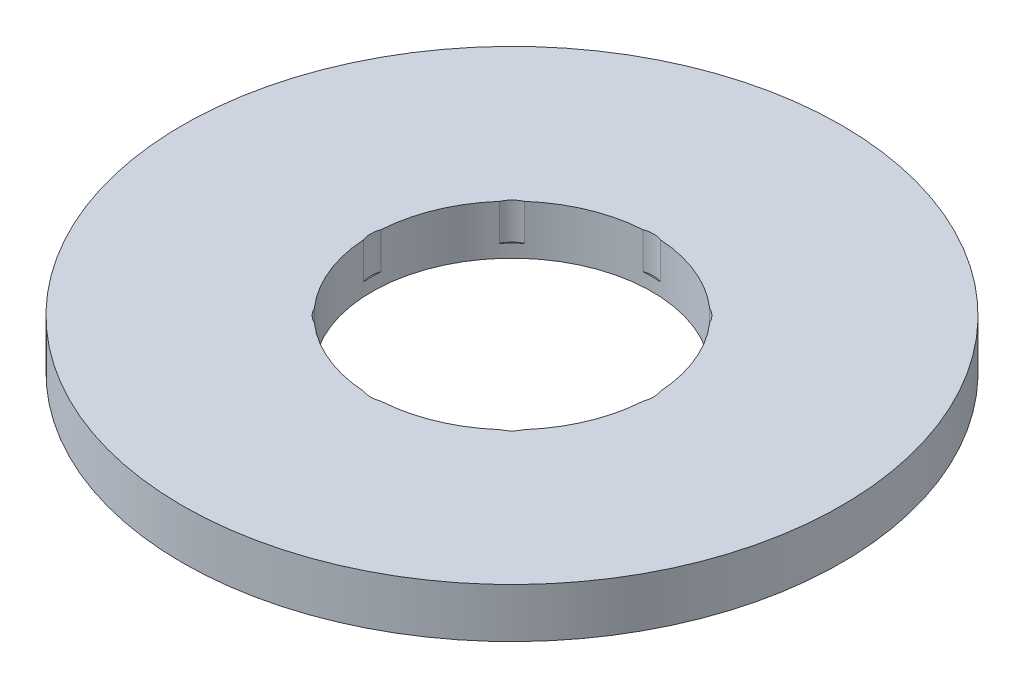
ISO-10303-21;
HEADER;
FILE_DESCRIPTION(('STEP AP214'),'2;1');
FILE_NAME('part.step','',(''),(''),'','','');
FILE_SCHEMA(('AUTOMOTIVE_DESIGN { 1 0 10303 214 1 1 1 1 }'));
ENDSEC;
DATA;
#1=APPLICATION_CONTEXT('core data for automotive mechanical design processes');
#2=APPLICATION_PROTOCOL_DEFINITION('international standard','automotive_design',2000,#1);
#3=PRODUCT_CONTEXT('',#1,'mechanical');
#4=PRODUCT('Part','Part','',(#3));
#5=PRODUCT_RELATED_PRODUCT_CATEGORY('part','',(#4));
#6=PRODUCT_DEFINITION_FORMATION('','',#4);
#7=PRODUCT_DEFINITION_CONTEXT('part definition',#1,'design');
#8=PRODUCT_DEFINITION('design','',#6,#7);
#9=PRODUCT_DEFINITION_SHAPE('','',#8);
#10=(LENGTH_UNIT() NAMED_UNIT(*) SI_UNIT(.MILLI.,.METRE.));
#11=(NAMED_UNIT(*) PLANE_ANGLE_UNIT() SI_UNIT($,.RADIAN.));
#12=(NAMED_UNIT(*) SI_UNIT($,.STERADIAN.) SOLID_ANGLE_UNIT());
#13=UNCERTAINTY_MEASURE_WITH_UNIT(LENGTH_MEASURE(1.E-05),#10,'distance_accuracy_value','');
#14=(GEOMETRIC_REPRESENTATION_CONTEXT(3) GLOBAL_UNCERTAINTY_ASSIGNED_CONTEXT((#13)) GLOBAL_UNIT_ASSIGNED_CONTEXT((#10,
#11,#12)) REPRESENTATION_CONTEXT('',''));
#15=CARTESIAN_POINT('',(0.,0.,0.));
#16=DIRECTION('',(0.,0.,1.));
#17=DIRECTION('',(1.,0.,0.));
#18=AXIS2_PLACEMENT_3D('',#15,#16,#17);
#19=CARTESIAN_POINT('',(0.,15.,0.));
#20=DIRECTION('',(0.,-1.,0.));
#21=DIRECTION('',(0.,0.,-1.));
#22=AXIS2_PLACEMENT_3D('',#19,#20,#21);
#23=CYLINDRICAL_SURFACE('',#22,100.);
#24=CARTESIAN_POINT('',(0.,15.,0.));
#25=DIRECTION('',(0.,1.,0.));
#26=DIRECTION('',(0.,0.,1.));
#27=AXIS2_PLACEMENT_3D('',#24,#25,#26);
#28=CIRCLE('',#27,100.);
#29=CARTESIAN_POINT('',(0.,15.,100.));
#30=VERTEX_POINT('',#29);
#31=EDGE_CURVE('E183',#30,#30,#28,.T.);
#32=ORIENTED_EDGE('',*,*,#31,.F.);
#33=EDGE_LOOP('',(#32));
#34=FACE_BOUND('',#33,.T.);
#35=CARTESIAN_POINT('',(0.,0.,0.));
#36=DIRECTION('',(0.,1.,0.));
#37=DIRECTION('',(0.,0.,1.));
#38=AXIS2_PLACEMENT_3D('',#35,#36,#37);
#39=CIRCLE('',#38,100.);
#40=CARTESIAN_POINT('',(0.,0.,100.));
#41=VERTEX_POINT('',#40);
#42=EDGE_CURVE('E182',#41,#41,#39,.T.);
#43=ORIENTED_EDGE('',*,*,#42,.T.);
#44=EDGE_LOOP('',(#43));
#45=FACE_BOUND('',#44,.T.);
#46=ADVANCED_FACE('F39',(#34,#45),#23,.T.);
#47=CARTESIAN_POINT('',(0.,15.,0.));
#48=DIRECTION('',(0.,1.,0.));
#49=DIRECTION('',(0.,0.,1.));
#50=AXIS2_PLACEMENT_3D('',#47,#48,#49);
#51=PLANE('',#50);
#52=CARTESIAN_POINT('',(1.22882616047543E-13,15.,35.1949800448479));
#53=DIRECTION('',(0.,1.,0.));
#54=DIRECTION('',(1.,0.,0.));
#55=AXIS2_PLACEMENT_3D('',#52,#53,#54);
#56=CIRCLE('',#55,7.70091066185478);
#57=CARTESIAN_POINT('',(-2.6770563312344,15.,42.4156029003408));
#58=VERTEX_POINT('',#57);
#59=CARTESIAN_POINT('',(2.6770563312347,15.,42.4156029003408));
#60=VERTEX_POINT('',#59);
#61=EDGE_CURVE('E256',#58,#60,#56,.T.);
#62=ORIENTED_EDGE('',*,*,#61,.F.);
#63=CARTESIAN_POINT('',(0.,15.,0.));
#64=DIRECTION('',(0.,1.,0.));
#65=DIRECTION('',(0.,0.,1.));
#66=AXIS2_PLACEMENT_3D('',#63,#64,#65);
#67=CIRCLE('',#66,42.5);
#68=CARTESIAN_POINT('',(-28.0993957535124,15.,31.8853251243812));
#69=VERTEX_POINT('',#68);
#70=EDGE_CURVE('E175',#69,#58,#67,.T.);
#71=ORIENTED_EDGE('',*,*,#70,.F.);
#72=CARTESIAN_POINT('',(-24.8866090534372,15.,24.8866090534372));
#73=DIRECTION('',(0.,1.,0.));
#74=DIRECTION('',(0.707106781186549,0.,0.707106781186546));
#75=AXIS2_PLACEMENT_3D('',#72,#73,#74);
#76=CIRCLE('',#75,7.70091066185478);
#77=CARTESIAN_POINT('',(-31.8853251243811,15.,28.0993957535125));
#78=VERTEX_POINT('',#77);
#79=EDGE_CURVE('E152',#78,#69,#76,.T.);
#80=ORIENTED_EDGE('',*,*,#79,.F.);
#81=CARTESIAN_POINT('',(-42.4156029003408,15.,2.67705633123455));
#82=VERTEX_POINT('',#81);
#83=EDGE_CURVE('E168',#82,#78,#67,.T.);
#84=ORIENTED_EDGE('',*,*,#83,.F.);
#85=CARTESIAN_POINT('',(-35.1949800448479,15.,0.));
#86=DIRECTION('',(0.,1.,0.));
#87=DIRECTION('',(0.,0.,1.));
#88=AXIS2_PLACEMENT_3D('',#85,#86,#87);
#89=CIRCLE('',#88,7.70091066185478);
#90=CARTESIAN_POINT('',(-42.4156029003408,15.,-2.67705633123455));
#91=VERTEX_POINT('',#90);
#92=EDGE_CURVE('E205',#91,#82,#89,.T.);
#93=ORIENTED_EDGE('',*,*,#92,.F.);
#94=CARTESIAN_POINT('',(-31.8853251243814,15.,-28.099395753512));
#95=VERTEX_POINT('',#94);
#96=EDGE_CURVE('E181',#95,#91,#67,.T.);
#97=ORIENTED_EDGE('',*,*,#96,.F.);
#98=CARTESIAN_POINT('',(-24.8866090534375,15.,-24.8866090534369));
#99=DIRECTION('',(0.,1.,0.));
#100=DIRECTION('',(-0.707106781186539,0.,0.707106781186556));
#101=AXIS2_PLACEMENT_3D('',#98,#99,#100);
#102=CIRCLE('',#101,7.70091066185478);
#103=CARTESIAN_POINT('',(-28.0993957535128,15.,-31.8853251243807));
#104=VERTEX_POINT('',#103);
#105=EDGE_CURVE('E453',#104,#95,#102,.T.);
#106=ORIENTED_EDGE('',*,*,#105,.F.);
#107=CARTESIAN_POINT('',(-2.67705633123499,15.,-42.4156029003408));
#108=VERTEX_POINT('',#107);
#109=EDGE_CURVE('E189',#108,#104,#67,.T.);
#110=ORIENTED_EDGE('',*,*,#109,.F.);
#111=CARTESIAN_POINT('',(-3.68647848142629E-13,15.,-35.1949800448479));
#112=DIRECTION('',(0.,1.,0.));
#113=DIRECTION('',(-1.,0.,0.));
#114=AXIS2_PLACEMENT_3D('',#111,#112,#113);
#115=CIRCLE('',#114,7.70091066185478);
#116=CARTESIAN_POINT('',(2.6770563312341,15.,-42.4156029003408));
#117=VERTEX_POINT('',#116);
#118=EDGE_CURVE('E462',#117,#108,#115,.T.);
#119=ORIENTED_EDGE('',*,*,#118,.F.);
#120=CARTESIAN_POINT('',(28.0993957535122,15.,-31.8853251243813));
#121=VERTEX_POINT('',#120);
#122=EDGE_CURVE('E197',#121,#117,#67,.T.);
#123=ORIENTED_EDGE('',*,*,#122,.F.);
#124=CARTESIAN_POINT('',(24.886609053437,15.,-24.8866090534374));
#125=DIRECTION('',(0.,1.,0.));
#126=DIRECTION('',(-0.707106781186554,0.,-0.707106781186541));
#127=AXIS2_PLACEMENT_3D('',#124,#125,#126);
#128=CIRCLE('',#127,7.70091066185478);
#129=CARTESIAN_POINT('',(31.8853251243808,15.,-28.0993957535127));
#130=VERTEX_POINT('',#129);
#131=EDGE_CURVE('E470',#130,#121,#128,.T.);
#132=ORIENTED_EDGE('',*,*,#131,.F.);
#133=CARTESIAN_POINT('',(42.4156029003408,15.,-2.67705633123455));
#134=VERTEX_POINT('',#133);
#135=EDGE_CURVE('E489',#134,#130,#67,.T.);
#136=ORIENTED_EDGE('',*,*,#135,.F.);
#137=CARTESIAN_POINT('',(35.1949800448479,15.,0.));
#138=DIRECTION('',(0.,1.,0.));
#139=DIRECTION('',(0.,0.,-1.));
#140=AXIS2_PLACEMENT_3D('',#137,#138,#139);
#141=CIRCLE('',#140,7.70091066185478);
#142=CARTESIAN_POINT('',(42.4156029003408,15.,2.67705633123455));
#143=VERTEX_POINT('',#142);
#144=EDGE_CURVE('E476',#143,#134,#141,.T.);
#145=ORIENTED_EDGE('',*,*,#144,.F.);
#146=CARTESIAN_POINT('',(31.8853251243812,15.,28.0993957535123));
#147=VERTEX_POINT('',#146);
#148=EDGE_CURVE('E491',#147,#143,#67,.T.);
#149=ORIENTED_EDGE('',*,*,#148,.F.);
#150=CARTESIAN_POINT('',(24.8866090534373,15.,24.8866090534371));
#151=DIRECTION('',(0.,1.,0.));
#152=DIRECTION('',(0.707106781186544,0.,-0.707106781186551));
#153=AXIS2_PLACEMENT_3D('',#150,#151,#152);
#154=CIRCLE('',#153,7.70091066185478);
#155=CARTESIAN_POINT('',(28.0993957535126,15.,31.8853251243809));
#156=VERTEX_POINT('',#155);
#157=EDGE_CURVE('E475',#156,#147,#154,.T.);
#158=ORIENTED_EDGE('',*,*,#157,.F.);
#159=EDGE_CURVE('E190',#60,#156,#67,.T.);
#160=ORIENTED_EDGE('',*,*,#159,.F.);
#161=EDGE_LOOP('',(#62,#71,#80,#84,#93,#97,#106,#110,#119,#123,#132,#136,#145,#149,#158,#160));
#162=FACE_BOUND('',#161,.T.);
#163=ORIENTED_EDGE('',*,*,#31,.T.);
#164=EDGE_LOOP('',(#163));
#165=FACE_BOUND('',#164,.T.);
#166=ADVANCED_FACE('F170',(#162,#165),#51,.T.);
#167=CARTESIAN_POINT('',(0.,0.,0.));
#168=DIRECTION('',(0.,1.,0.));
#169=DIRECTION('',(0.,0.,1.));
#170=AXIS2_PLACEMENT_3D('',#167,#168,#169);
#171=PLANE('',#170);
#172=CARTESIAN_POINT('',(0.,0.,0.));
#173=DIRECTION('',(0.,1.,0.));
#174=DIRECTION('',(0.,0.,1.));
#175=AXIS2_PLACEMENT_3D('',#172,#173,#174);
#176=CIRCLE('',#175,42.5);
#177=CARTESIAN_POINT('',(0.,0.,42.5));
#178=VERTEX_POINT('',#177);
#179=EDGE_CURVE('E191',#178,#178,#176,.T.);
#180=ORIENTED_EDGE('',*,*,#179,.T.);
#181=EDGE_LOOP('',(#180));
#182=FACE_BOUND('',#181,.T.);
#183=ORIENTED_EDGE('',*,*,#42,.F.);
#184=EDGE_LOOP('',(#183));
#185=FACE_BOUND('',#184,.T.);
#186=ADVANCED_FACE('F277',(#182,#185),#171,.F.);
#187=CARTESIAN_POINT('',(0.,15.,0.));
#188=DIRECTION('',(0.,-1.,0.));
#189=DIRECTION('',(0.,0.,-1.));
#190=AXIS2_PLACEMENT_3D('',#187,#188,#189);
#191=CYLINDRICAL_SURFACE('',#190,42.5);
#192=DIRECTION('',(0.,1.,0.));
#193=VECTOR('',#192,1.);
#194=CARTESIAN_POINT('',(-2.67705633123445,9.47797461563114,42.4156029003408));
#195=LINE('',#194,#193);
#196=CARTESIAN_POINT('',(-2.6770563312344,3.95594923126228,42.4156029003408));
#197=VERTEX_POINT('',#196);
#198=EDGE_CURVE('E11',#197,#58,#195,.T.);
#199=ORIENTED_EDGE('',*,*,#198,.F.);
#200=CARTESIAN_POINT('',(0.,3.95594923126228,0.));
#201=DIRECTION('',(0.,1.,0.));
#202=DIRECTION('',(0.,0.,1.));
#203=AXIS2_PLACEMENT_3D('',#200,#201,#202);
#204=CIRCLE('',#203,42.5);
#205=CARTESIAN_POINT('',(2.6770563312347,3.95594923126228,42.4156029003408));
#206=VERTEX_POINT('',#205);
#207=EDGE_CURVE('E251',#197,#206,#204,.T.);
#208=ORIENTED_EDGE('',*,*,#207,.T.);
#209=DIRECTION('',(0.,1.,0.));
#210=VECTOR('',#209,1.);
#211=CARTESIAN_POINT('',(2.67705633123475,9.47797461563114,42.4156029003408));
#212=LINE('',#211,#210);
#213=EDGE_CURVE('E46',#60,#206,#212,.F.);
#214=ORIENTED_EDGE('',*,*,#213,.F.);
#215=ORIENTED_EDGE('',*,*,#159,.T.);
#216=DIRECTION('',(0.,1.,0.));
#217=VECTOR('',#216,1.);
#218=CARTESIAN_POINT('',(28.0993957535126,9.47797461563114,31.885325124381));
#219=LINE('',#218,#217);
#220=CARTESIAN_POINT('',(28.0993957535126,3.95594923126228,31.8853251243809));
#221=VERTEX_POINT('',#220);
#222=EDGE_CURVE('E253',#221,#156,#219,.T.);
#223=ORIENTED_EDGE('',*,*,#222,.F.);
#224=CARTESIAN_POINT('',(0.,3.95594923126228,0.));
#225=DIRECTION('',(0.,1.,0.));
#226=DIRECTION('',(0.,0.,1.));
#227=AXIS2_PLACEMENT_3D('',#224,#225,#226);
#228=CIRCLE('',#227,42.5);
#229=CARTESIAN_POINT('',(31.8853251243812,3.95594923126228,28.0993957535123));
#230=VERTEX_POINT('',#229);
#231=EDGE_CURVE('E246',#221,#230,#228,.T.);
#232=ORIENTED_EDGE('',*,*,#231,.T.);
#233=DIRECTION('',(0.,1.,0.));
#234=VECTOR('',#233,1.);
#235=CARTESIAN_POINT('',(31.8853251243813,9.47797461563114,28.0993957535122));
#236=LINE('',#235,#234);
#237=EDGE_CURVE('E248',#147,#230,#236,.F.);
#238=ORIENTED_EDGE('',*,*,#237,.F.);
#239=ORIENTED_EDGE('',*,*,#148,.T.);
#240=DIRECTION('',(0.,1.,0.));
#241=VECTOR('',#240,1.);
#242=CARTESIAN_POINT('',(42.4156029003408,9.47797461563114,2.6770563312346));
#243=LINE('',#242,#241);
#244=CARTESIAN_POINT('',(42.4156029003408,3.95594923126228,2.67705633123455));
#245=VERTEX_POINT('',#244);
#246=EDGE_CURVE('E243',#245,#143,#243,.T.);
#247=ORIENTED_EDGE('',*,*,#246,.F.);
#248=CARTESIAN_POINT('',(0.,3.95594923126228,0.));
#249=DIRECTION('',(0.,1.,0.));
#250=DIRECTION('',(0.,0.,1.));
#251=AXIS2_PLACEMENT_3D('',#248,#249,#250);
#252=CIRCLE('',#251,42.5);
#253=CARTESIAN_POINT('',(42.4156029003408,3.95594923126228,-2.67705633123455));
#254=VERTEX_POINT('',#253);
#255=EDGE_CURVE('E236',#245,#254,#252,.T.);
#256=ORIENTED_EDGE('',*,*,#255,.T.);
#257=DIRECTION('',(0.,1.,0.));
#258=VECTOR('',#257,1.);
#259=CARTESIAN_POINT('',(42.4156029003408,9.47797461563114,-2.6770563312346));
#260=LINE('',#259,#258);
#261=EDGE_CURVE('E241',#134,#254,#260,.F.);
#262=ORIENTED_EDGE('',*,*,#261,.F.);
#263=ORIENTED_EDGE('',*,*,#135,.T.);
#264=DIRECTION('',(0.,1.,0.));
#265=VECTOR('',#264,1.);
#266=CARTESIAN_POINT('',(31.8853251243809,9.47797461563114,-28.0993957535127));
#267=LINE('',#266,#265);
#268=CARTESIAN_POINT('',(31.8853251243808,3.95594923126228,-28.0993957535127));
#269=VERTEX_POINT('',#268);
#270=EDGE_CURVE('E237',#269,#130,#267,.T.);
#271=ORIENTED_EDGE('',*,*,#270,.F.);
#272=CARTESIAN_POINT('',(0.,3.95594923126228,0.));
#273=DIRECTION('',(0.,1.,0.));
#274=DIRECTION('',(0.,0.,1.));
#275=AXIS2_PLACEMENT_3D('',#272,#273,#274);
#276=CIRCLE('',#275,42.5);
#277=CARTESIAN_POINT('',(28.0993957535122,3.95594923126228,-31.8853251243813));
#278=VERTEX_POINT('',#277);
#279=EDGE_CURVE('E229',#269,#278,#276,.T.);
#280=ORIENTED_EDGE('',*,*,#279,.T.);
#281=DIRECTION('',(0.,1.,0.));
#282=VECTOR('',#281,1.);
#283=CARTESIAN_POINT('',(28.0993957535121,9.47797461563114,-31.8853251243814));
#284=LINE('',#283,#282);
#285=EDGE_CURVE('E232',#121,#278,#284,.F.);
#286=ORIENTED_EDGE('',*,*,#285,.F.);
#287=ORIENTED_EDGE('',*,*,#122,.T.);
#288=DIRECTION('',(0.,1.,0.));
#289=VECTOR('',#288,1.);
#290=CARTESIAN_POINT('',(2.67705633123415,9.47797461563114,-42.4156029003408));
#291=LINE('',#290,#289);
#292=CARTESIAN_POINT('',(2.6770563312341,3.95594923126228,-42.4156029003408));
#293=VERTEX_POINT('',#292);
#294=EDGE_CURVE('E227',#293,#117,#291,.T.);
#295=ORIENTED_EDGE('',*,*,#294,.F.);
#296=CARTESIAN_POINT('',(0.,3.95594923126228,0.));
#297=DIRECTION('',(0.,1.,0.));
#298=DIRECTION('',(0.,0.,1.));
#299=AXIS2_PLACEMENT_3D('',#296,#297,#298);
#300=CIRCLE('',#299,42.5);
#301=CARTESIAN_POINT('',(-2.67705633123499,3.95594923126228,-42.4156029003408));
#302=VERTEX_POINT('',#301);
#303=EDGE_CURVE('E225',#293,#302,#300,.T.);
#304=ORIENTED_EDGE('',*,*,#303,.T.);
#305=DIRECTION('',(0.,1.,0.));
#306=VECTOR('',#305,1.);
#307=CARTESIAN_POINT('',(-2.67705633123504,9.47797461563114,-42.4156029003407));
#308=LINE('',#307,#306);
#309=EDGE_CURVE('E223',#108,#302,#308,.F.);
#310=ORIENTED_EDGE('',*,*,#309,.F.);
#311=ORIENTED_EDGE('',*,*,#109,.T.);
#312=DIRECTION('',(0.,1.,0.));
#313=VECTOR('',#312,1.);
#314=CARTESIAN_POINT('',(-28.0993957535128,9.47797461563114,-31.8853251243808));
#315=LINE('',#314,#313);
#316=CARTESIAN_POINT('',(-28.0993957535128,3.95594923126228,-31.8853251243807));
#317=VERTEX_POINT('',#316);
#318=EDGE_CURVE('E219',#317,#104,#315,.T.);
#319=ORIENTED_EDGE('',*,*,#318,.F.);
#320=CARTESIAN_POINT('',(0.,3.95594923126228,0.));
#321=DIRECTION('',(0.,1.,0.));
#322=DIRECTION('',(0.,0.,1.));
#323=AXIS2_PLACEMENT_3D('',#320,#321,#322);
#324=CIRCLE('',#323,42.5);
#325=CARTESIAN_POINT('',(-31.8853251243814,3.95594923126228,-28.099395753512));
#326=VERTEX_POINT('',#325);
#327=EDGE_CURVE('E159',#317,#326,#324,.T.);
#328=ORIENTED_EDGE('',*,*,#327,.T.);
#329=DIRECTION('',(0.,1.,0.));
#330=VECTOR('',#329,1.);
#331=CARTESIAN_POINT('',(-31.8853251243815,9.47797461563114,-28.099395753512));
#332=LINE('',#331,#330);
#333=EDGE_CURVE('E220',#95,#326,#332,.F.);
#334=ORIENTED_EDGE('',*,*,#333,.F.);
#335=ORIENTED_EDGE('',*,*,#96,.T.);
#336=DIRECTION('',(0.,1.,0.));
#337=VECTOR('',#336,1.);
#338=CARTESIAN_POINT('',(-42.4156029003408,9.47797461563114,-2.6770563312346));
#339=LINE('',#338,#337);
#340=CARTESIAN_POINT('',(-42.4156029003408,3.95594923126228,-2.67705633123455));
#341=VERTEX_POINT('',#340);
#342=EDGE_CURVE('E209',#341,#91,#339,.T.);
#343=ORIENTED_EDGE('',*,*,#342,.F.);
#344=CARTESIAN_POINT('',(0.,3.95594923126228,0.));
#345=DIRECTION('',(0.,1.,0.));
#346=DIRECTION('',(0.,0.,1.));
#347=AXIS2_PLACEMENT_3D('',#344,#345,#346);
#348=CIRCLE('',#347,42.5);
#349=CARTESIAN_POINT('',(-42.4156029003408,3.95594923126228,2.67705633123455));
#350=VERTEX_POINT('',#349);
#351=EDGE_CURVE('E206',#341,#350,#348,.T.);
#352=ORIENTED_EDGE('',*,*,#351,.T.);
#353=DIRECTION('',(0.,1.,0.));
#354=VECTOR('',#353,1.);
#355=CARTESIAN_POINT('',(-42.4156029003408,9.47797461563114,2.6770563312346));
#356=LINE('',#355,#354);
#357=EDGE_CURVE('E179',#82,#350,#356,.F.);
#358=ORIENTED_EDGE('',*,*,#357,.F.);
#359=ORIENTED_EDGE('',*,*,#83,.T.);
#360=DIRECTION('',(0.,1.,0.));
#361=VECTOR('',#360,1.);
#362=CARTESIAN_POINT('',(-31.8853251243811,9.47797461563114,28.0993957535124));
#363=LINE('',#362,#361);
#364=CARTESIAN_POINT('',(-31.8853251243811,3.95594923126228,28.0993957535125));
#365=VERTEX_POINT('',#364);
#366=EDGE_CURVE('E147',#365,#78,#363,.T.);
#367=ORIENTED_EDGE('',*,*,#366,.F.);
#368=CARTESIAN_POINT('',(0.,3.95594923126228,0.));
#369=DIRECTION('',(0.,1.,0.));
#370=DIRECTION('',(0.,0.,1.));
#371=AXIS2_PLACEMENT_3D('',#368,#369,#370);
#372=CIRCLE('',#371,42.5);
#373=CARTESIAN_POINT('',(-28.0993957535124,3.95594923126228,31.8853251243812));
#374=VERTEX_POINT('',#373);
#375=EDGE_CURVE('E215',#365,#374,#372,.T.);
#376=ORIENTED_EDGE('',*,*,#375,.T.);
#377=DIRECTION('',(0.,1.,0.));
#378=VECTOR('',#377,1.);
#379=CARTESIAN_POINT('',(-28.0993957535123,9.47797461563114,31.8853251243812));
#380=LINE('',#379,#378);
#381=EDGE_CURVE('E161',#69,#374,#380,.F.);
#382=ORIENTED_EDGE('',*,*,#381,.F.);
#383=ORIENTED_EDGE('',*,*,#70,.T.);
#384=EDGE_LOOP('',(#199,#208,#214,#215,#223,#232,#238,#239,#247,#256,#262,#263,#271,#280,#286,
#287,#295,#304,#310,#311,#319,#328,#334,#335,#343,#352,#358,#359,#367,#376,#382,#383));
#385=FACE_BOUND('',#384,.T.);
#386=ORIENTED_EDGE('',*,*,#179,.F.);
#387=EDGE_LOOP('',(#386));
#388=FACE_BOUND('',#387,.T.);
#389=ADVANCED_FACE('F176',(#385,#388),#191,.F.);
#390=CARTESIAN_POINT('',(-35.1949800448479,3.95594923126228,0.));
#391=DIRECTION('',(0.,1.,0.));
#392=DIRECTION('',(0.,0.,1.));
#393=AXIS2_PLACEMENT_3D('',#390,#391,#392);
#394=CYLINDRICAL_SURFACE('',#393,7.70091066185478);
#395=ORIENTED_EDGE('',*,*,#342,.T.);
#396=ORIENTED_EDGE('',*,*,#92,.T.);
#397=ORIENTED_EDGE('',*,*,#357,.T.);
#398=CARTESIAN_POINT('',(-35.1949800448479,3.95594923126228,0.));
#399=DIRECTION('',(0.,1.,0.));
#400=DIRECTION('',(0.,0.,1.));
#401=AXIS2_PLACEMENT_3D('',#398,#399,#400);
#402=CIRCLE('',#401,7.70091066185478);
#403=EDGE_CURVE('E200',#341,#350,#402,.T.);
#404=ORIENTED_EDGE('',*,*,#403,.F.);
#405=EDGE_LOOP('',(#395,#396,#397,#404));
#406=FACE_BOUND('',#405,.T.);
#407=ADVANCED_FACE('F286',(#406),#394,.F.);
#408=CARTESIAN_POINT('',(-35.1949800448479,3.95594923126228,0.));
#409=DIRECTION('',(0.,1.,0.));
#410=DIRECTION('',(0.,0.,1.));
#411=AXIS2_PLACEMENT_3D('',#408,#409,#410);
#412=PLANE('',#411);
#413=ORIENTED_EDGE('',*,*,#403,.T.);
#414=ORIENTED_EDGE('',*,*,#351,.F.);
#415=EDGE_LOOP('',(#413,#414));
#416=FACE_BOUND('',#415,.T.);
#417=ADVANCED_FACE('F289',(#416),#412,.T.);
#418=CARTESIAN_POINT('',(-24.8866090534372,3.95594923126228,24.8866090534372));
#419=DIRECTION('',(0.,1.,0.));
#420=DIRECTION('',(0.,0.,1.));
#421=AXIS2_PLACEMENT_3D('',#418,#419,#420);
#422=CYLINDRICAL_SURFACE('',#421,7.70091066185478);
#423=ORIENTED_EDGE('',*,*,#366,.T.);
#424=ORIENTED_EDGE('',*,*,#79,.T.);
#425=ORIENTED_EDGE('',*,*,#381,.T.);
#426=CARTESIAN_POINT('',(-24.8866090534372,3.95594923126228,24.8866090534372));
#427=DIRECTION('',(0.,1.,0.));
#428=DIRECTION('',(0.707106781186549,0.,0.707106781186546));
#429=AXIS2_PLACEMENT_3D('',#426,#427,#428);
#430=CIRCLE('',#429,7.70091066185478);
#431=EDGE_CURVE('E156',#365,#374,#430,.T.);
#432=ORIENTED_EDGE('',*,*,#431,.F.);
#433=EDGE_LOOP('',(#423,#424,#425,#432));
#434=FACE_BOUND('',#433,.T.);
#435=ADVANCED_FACE('F155',(#434),#422,.F.);
#436=CARTESIAN_POINT('',(-24.8866090534372,3.95594923126228,24.8866090534372));
#437=DIRECTION('',(0.,1.,0.));
#438=DIRECTION('',(0.707106781186549,0.,0.707106781186546));
#439=AXIS2_PLACEMENT_3D('',#436,#437,#438);
#440=PLANE('',#439);
#441=ORIENTED_EDGE('',*,*,#431,.T.);
#442=ORIENTED_EDGE('',*,*,#375,.F.);
#443=EDGE_LOOP('',(#441,#442));
#444=FACE_BOUND('',#443,.T.);
#445=ADVANCED_FACE('F300',(#444),#440,.T.);
#446=CARTESIAN_POINT('',(-24.8866090534375,3.95594923126228,-24.8866090534369));
#447=DIRECTION('',(0.,1.,0.));
#448=DIRECTION('',(0.,0.,1.));
#449=AXIS2_PLACEMENT_3D('',#446,#447,#448);
#450=CYLINDRICAL_SURFACE('',#449,7.70091066185478);
#451=ORIENTED_EDGE('',*,*,#318,.T.);
#452=ORIENTED_EDGE('',*,*,#105,.T.);
#453=ORIENTED_EDGE('',*,*,#333,.T.);
#454=CARTESIAN_POINT('',(-24.8866090534375,3.95594923126228,-24.8866090534369));
#455=DIRECTION('',(0.,1.,0.));
#456=DIRECTION('',(-0.707106781186539,0.,0.707106781186556));
#457=AXIS2_PLACEMENT_3D('',#454,#455,#456);
#458=CIRCLE('',#457,7.70091066185478);
#459=EDGE_CURVE('E454',#317,#326,#458,.T.);
#460=ORIENTED_EDGE('',*,*,#459,.F.);
#461=EDGE_LOOP('',(#451,#452,#453,#460));
#462=FACE_BOUND('',#461,.T.);
#463=ADVANCED_FACE('F299',(#462),#450,.F.);
#464=CARTESIAN_POINT('',(-24.8866090534375,3.95594923126228,-24.8866090534369));
#465=DIRECTION('',(0.,1.,0.));
#466=DIRECTION('',(-0.707106781186539,0.,0.707106781186556));
#467=AXIS2_PLACEMENT_3D('',#464,#465,#466);
#468=PLANE('',#467);
#469=ORIENTED_EDGE('',*,*,#459,.T.);
#470=ORIENTED_EDGE('',*,*,#327,.F.);
#471=EDGE_LOOP('',(#469,#470));
#472=FACE_BOUND('',#471,.T.);
#473=ADVANCED_FACE('F379',(#472),#468,.T.);
#474=CARTESIAN_POINT('',(-3.68647848142629E-13,3.95594923126228,-35.1949800448479));
#475=DIRECTION('',(0.,1.,0.));
#476=DIRECTION('',(0.,0.,1.));
#477=AXIS2_PLACEMENT_3D('',#474,#475,#476);
#478=CYLINDRICAL_SURFACE('',#477,7.70091066185478);
#479=ORIENTED_EDGE('',*,*,#294,.T.);
#480=ORIENTED_EDGE('',*,*,#118,.T.);
#481=ORIENTED_EDGE('',*,*,#309,.T.);
#482=CARTESIAN_POINT('',(-3.68647848142629E-13,3.95594923126228,-35.1949800448479));
#483=DIRECTION('',(0.,1.,0.));
#484=DIRECTION('',(-1.,0.,0.));
#485=AXIS2_PLACEMENT_3D('',#482,#483,#484);
#486=CIRCLE('',#485,7.70091066185478);
#487=EDGE_CURVE('E465',#293,#302,#486,.T.);
#488=ORIENTED_EDGE('',*,*,#487,.F.);
#489=EDGE_LOOP('',(#479,#480,#481,#488));
#490=FACE_BOUND('',#489,.T.);
#491=ADVANCED_FACE('F371',(#490),#478,.F.);
#492=CARTESIAN_POINT('',(-3.68647848142629E-13,3.95594923126228,-35.1949800448479));
#493=DIRECTION('',(0.,1.,0.));
#494=DIRECTION('',(-1.,0.,0.));
#495=AXIS2_PLACEMENT_3D('',#492,#493,#494);
#496=PLANE('',#495);
#497=ORIENTED_EDGE('',*,*,#487,.T.);
#498=ORIENTED_EDGE('',*,*,#303,.F.);
#499=EDGE_LOOP('',(#497,#498));
#500=FACE_BOUND('',#499,.T.);
#501=ADVANCED_FACE('F308',(#500),#496,.T.);
#502=CARTESIAN_POINT('',(24.886609053437,3.95594923126228,-24.8866090534374));
#503=DIRECTION('',(0.,1.,0.));
#504=DIRECTION('',(0.,0.,1.));
#505=AXIS2_PLACEMENT_3D('',#502,#503,#504);
#506=CYLINDRICAL_SURFACE('',#505,7.70091066185478);
#507=ORIENTED_EDGE('',*,*,#270,.T.);
#508=ORIENTED_EDGE('',*,*,#131,.T.);
#509=ORIENTED_EDGE('',*,*,#285,.T.);
#510=CARTESIAN_POINT('',(24.886609053437,3.95594923126228,-24.8866090534374));
#511=DIRECTION('',(0.,1.,0.));
#512=DIRECTION('',(-0.707106781186554,0.,-0.707106781186541));
#513=AXIS2_PLACEMENT_3D('',#510,#511,#512);
#514=CIRCLE('',#513,7.70091066185478);
#515=EDGE_CURVE('E477',#269,#278,#514,.T.);
#516=ORIENTED_EDGE('',*,*,#515,.F.);
#517=EDGE_LOOP('',(#507,#508,#509,#516));
#518=FACE_BOUND('',#517,.T.);
#519=ADVANCED_FACE('F305',(#518),#506,.F.);
#520=CARTESIAN_POINT('',(24.886609053437,3.95594923126228,-24.8866090534374));
#521=DIRECTION('',(0.,1.,0.));
#522=DIRECTION('',(-0.707106781186554,0.,-0.707106781186541));
#523=AXIS2_PLACEMENT_3D('',#520,#521,#522);
#524=PLANE('',#523);
#525=ORIENTED_EDGE('',*,*,#515,.T.);
#526=ORIENTED_EDGE('',*,*,#279,.F.);
#527=EDGE_LOOP('',(#525,#526));
#528=FACE_BOUND('',#527,.T.);
#529=ADVANCED_FACE('F304',(#528),#524,.T.);
#530=CARTESIAN_POINT('',(35.1949800448479,3.95594923126228,0.));
#531=DIRECTION('',(0.,1.,0.));
#532=DIRECTION('',(0.,0.,1.));
#533=AXIS2_PLACEMENT_3D('',#530,#531,#532);
#534=CYLINDRICAL_SURFACE('',#533,7.70091066185478);
#535=ORIENTED_EDGE('',*,*,#246,.T.);
#536=ORIENTED_EDGE('',*,*,#144,.T.);
#537=ORIENTED_EDGE('',*,*,#261,.T.);
#538=CARTESIAN_POINT('',(35.1949800448479,3.95594923126228,0.));
#539=DIRECTION('',(0.,1.,0.));
#540=DIRECTION('',(0.,0.,-1.));
#541=AXIS2_PLACEMENT_3D('',#538,#539,#540);
#542=CIRCLE('',#541,7.70091066185478);
#543=EDGE_CURVE('E478',#245,#254,#542,.T.);
#544=ORIENTED_EDGE('',*,*,#543,.F.);
#545=EDGE_LOOP('',(#535,#536,#537,#544));
#546=FACE_BOUND('',#545,.T.);
#547=ADVANCED_FACE('F309',(#546),#534,.F.);
#548=CARTESIAN_POINT('',(35.1949800448479,3.95594923126228,0.));
#549=DIRECTION('',(0.,1.,0.));
#550=DIRECTION('',(0.,0.,-1.));
#551=AXIS2_PLACEMENT_3D('',#548,#549,#550);
#552=PLANE('',#551);
#553=ORIENTED_EDGE('',*,*,#543,.T.);
#554=ORIENTED_EDGE('',*,*,#255,.F.);
#555=EDGE_LOOP('',(#553,#554));
#556=FACE_BOUND('',#555,.T.);
#557=ADVANCED_FACE('F314',(#556),#552,.T.);
#558=CARTESIAN_POINT('',(24.8866090534373,3.95594923126228,24.8866090534371));
#559=DIRECTION('',(0.,1.,0.));
#560=DIRECTION('',(0.,0.,1.));
#561=AXIS2_PLACEMENT_3D('',#558,#559,#560);
#562=CYLINDRICAL_SURFACE('',#561,7.70091066185478);
#563=ORIENTED_EDGE('',*,*,#222,.T.);
#564=ORIENTED_EDGE('',*,*,#157,.T.);
#565=ORIENTED_EDGE('',*,*,#237,.T.);
#566=CARTESIAN_POINT('',(24.8866090534373,3.95594923126228,24.8866090534371));
#567=DIRECTION('',(0.,1.,0.));
#568=DIRECTION('',(0.707106781186544,0.,-0.707106781186551));
#569=AXIS2_PLACEMENT_3D('',#566,#567,#568);
#570=CIRCLE('',#569,7.70091066185478);
#571=EDGE_CURVE('E56',#221,#230,#570,.T.);
#572=ORIENTED_EDGE('',*,*,#571,.F.);
#573=EDGE_LOOP('',(#563,#564,#565,#572));
#574=FACE_BOUND('',#573,.T.);
#575=ADVANCED_FACE('F318',(#574),#562,.F.);
#576=CARTESIAN_POINT('',(24.8866090534373,3.95594923126228,24.8866090534371));
#577=DIRECTION('',(0.,1.,0.));
#578=DIRECTION('',(0.707106781186544,0.,-0.707106781186551));
#579=AXIS2_PLACEMENT_3D('',#576,#577,#578);
#580=PLANE('',#579);
#581=ORIENTED_EDGE('',*,*,#571,.T.);
#582=ORIENTED_EDGE('',*,*,#231,.F.);
#583=EDGE_LOOP('',(#581,#582));
#584=FACE_BOUND('',#583,.T.);
#585=ADVANCED_FACE('F270',(#584),#580,.T.);
#586=CARTESIAN_POINT('',(1.22882616047543E-13,3.95594923126228,35.1949800448479));
#587=DIRECTION('',(0.,1.,0.));
#588=DIRECTION('',(0.,0.,1.));
#589=AXIS2_PLACEMENT_3D('',#586,#587,#588);
#590=CYLINDRICAL_SURFACE('',#589,7.70091066185478);
#591=ORIENTED_EDGE('',*,*,#198,.T.);
#592=ORIENTED_EDGE('',*,*,#61,.T.);
#593=ORIENTED_EDGE('',*,*,#213,.T.);
#594=CARTESIAN_POINT('',(1.22882616047543E-13,3.95594923126228,35.1949800448479));
#595=DIRECTION('',(0.,1.,0.));
#596=DIRECTION('',(1.,0.,0.));
#597=AXIS2_PLACEMENT_3D('',#594,#595,#596);
#598=CIRCLE('',#597,7.70091066185478);
#599=EDGE_CURVE('E55',#197,#206,#598,.T.);
#600=ORIENTED_EDGE('',*,*,#599,.F.);
#601=EDGE_LOOP('',(#591,#592,#593,#600));
#602=FACE_BOUND('',#601,.T.);
#603=ADVANCED_FACE('F260',(#602),#590,.F.);
#604=CARTESIAN_POINT('',(1.22882616047543E-13,3.95594923126228,35.1949800448479));
#605=DIRECTION('',(0.,1.,0.));
#606=DIRECTION('',(1.,0.,0.));
#607=AXIS2_PLACEMENT_3D('',#604,#605,#606);
#608=PLANE('',#607);
#609=ORIENTED_EDGE('',*,*,#599,.T.);
#610=ORIENTED_EDGE('',*,*,#207,.F.);
#611=EDGE_LOOP('',(#609,#610));
#612=FACE_BOUND('',#611,.T.);
#613=ADVANCED_FACE('F261',(#612),#608,.T.);
#614=CLOSED_SHELL('',(#46,#166,#186,#389,#407,#417,#435,#445,#463,#473,#491,#501,#519,#529,#547,
#557,#575,#585,#603,#613));
#615=MANIFOLD_SOLID_BREP('B2',#614);
#616=ADVANCED_BREP_SHAPE_REPRESENTATION('',(#18,#615),#14);
#617=SHAPE_DEFINITION_REPRESENTATION(#9,#616);
ENDSEC;
END-ISO-10303-21;
